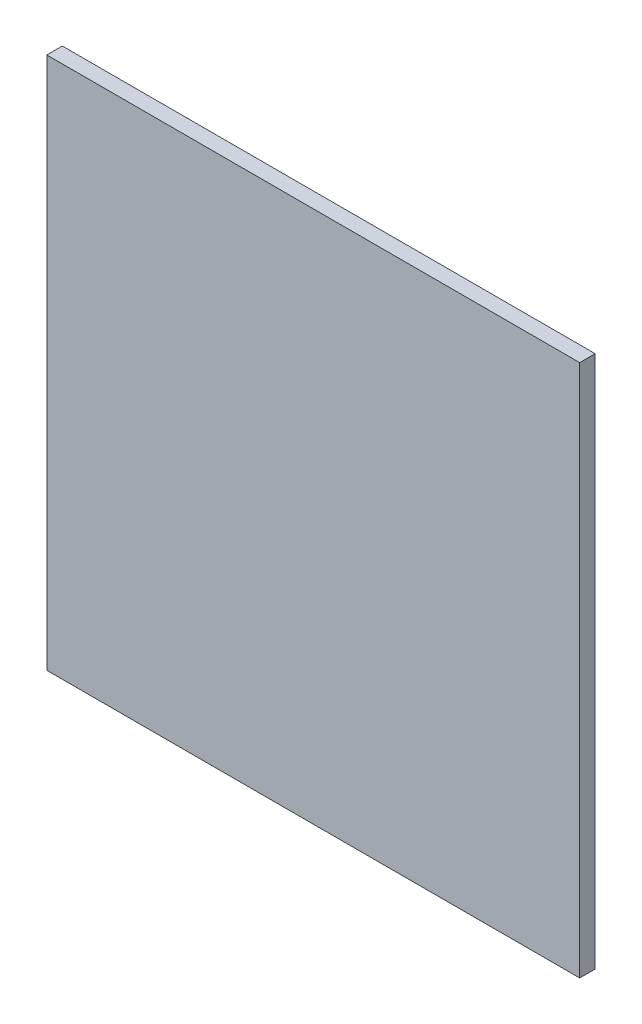
ISO-10303-21;
HEADER;
FILE_DESCRIPTION(('STEP AP214'),'2;1');
FILE_NAME('part.step','',(''),(''),'','','');
FILE_SCHEMA(('AUTOMOTIVE_DESIGN { 1 0 10303 214 1 1 1 1 }'));
ENDSEC;
DATA;
#1=APPLICATION_CONTEXT('core data for automotive mechanical design processes');
#2=APPLICATION_PROTOCOL_DEFINITION('international standard','automotive_design',2000,#1);
#3=PRODUCT_CONTEXT('',#1,'mechanical');
#4=PRODUCT('Part','Part','',(#3));
#5=PRODUCT_RELATED_PRODUCT_CATEGORY('part','',(#4));
#6=PRODUCT_DEFINITION_FORMATION('','',#4);
#7=PRODUCT_DEFINITION_CONTEXT('part definition',#1,'design');
#8=PRODUCT_DEFINITION('design','',#6,#7);
#9=PRODUCT_DEFINITION_SHAPE('','',#8);
#10=(LENGTH_UNIT() NAMED_UNIT(*) SI_UNIT(.MILLI.,.METRE.));
#11=(NAMED_UNIT(*) PLANE_ANGLE_UNIT() SI_UNIT($,.RADIAN.));
#12=(NAMED_UNIT(*) SI_UNIT($,.STERADIAN.) SOLID_ANGLE_UNIT());
#13=UNCERTAINTY_MEASURE_WITH_UNIT(LENGTH_MEASURE(1.E-05),#10,'distance_accuracy_value','');
#14=(GEOMETRIC_REPRESENTATION_CONTEXT(3) GLOBAL_UNCERTAINTY_ASSIGNED_CONTEXT((#13)) GLOBAL_UNIT_ASSIGNED_CONTEXT((#10,
#11,#12)) REPRESENTATION_CONTEXT('',''));
#15=CARTESIAN_POINT('',(0.,0.,0.));
#16=DIRECTION('',(0.,0.,1.));
#17=DIRECTION('',(1.,0.,0.));
#18=AXIS2_PLACEMENT_3D('',#15,#16,#17);
#19=CARTESIAN_POINT('',(-35.1974992724407,58.1059818265907,2.5));
#20=DIRECTION('',(1.,0.,0.));
#21=DIRECTION('',(0.,1.,0.));
#22=AXIS2_PLACEMENT_3D('',#19,#20,#21);
#23=PLANE('',#22);
#24=DIRECTION('',(0.,-1.,0.));
#25=VECTOR('',#24,1.);
#26=CARTESIAN_POINT('',(-35.1974992724407,58.1059818265907,0.));
#27=LINE('',#26,#25);
#28=CARTESIAN_POINT('',(-35.1974992724407,58.1059818265907,0.));
#29=VERTEX_POINT('',#28);
#30=CARTESIAN_POINT('',(-35.1974992724407,-27.8940181734093,0.));
#31=VERTEX_POINT('',#30);
#32=EDGE_CURVE('E95',#29,#31,#27,.T.);
#33=ORIENTED_EDGE('',*,*,#32,.T.);
#34=DIRECTION('',(0.,0.,-1.));
#35=VECTOR('',#34,1.);
#36=CARTESIAN_POINT('',(-35.1974992724407,-27.8940181734093,2.5));
#37=LINE('',#36,#35);
#38=CARTESIAN_POINT('',(-35.1974992724407,-27.8940181734093,2.5));
#39=VERTEX_POINT('',#38);
#40=EDGE_CURVE('E11',#39,#31,#37,.T.);
#41=ORIENTED_EDGE('',*,*,#40,.F.);
#42=DIRECTION('',(0.,-1.,0.));
#43=VECTOR('',#42,1.);
#44=CARTESIAN_POINT('',(-35.1974992724407,58.1059818265907,2.5));
#45=LINE('',#44,#43);
#46=CARTESIAN_POINT('',(-35.1974992724407,58.1059818265907,2.5));
#47=VERTEX_POINT('',#46);
#48=EDGE_CURVE('E83',#47,#39,#45,.T.);
#49=ORIENTED_EDGE('',*,*,#48,.F.);
#50=DIRECTION('',(0.,0.,-1.));
#51=VECTOR('',#50,1.);
#52=CARTESIAN_POINT('',(-35.1974992724407,58.1059818265907,2.5));
#53=LINE('',#52,#51);
#54=EDGE_CURVE('E91',#47,#29,#53,.T.);
#55=ORIENTED_EDGE('',*,*,#54,.T.);
#56=EDGE_LOOP('',(#33,#41,#49,#55));
#57=FACE_BOUND('',#56,.T.);
#58=ADVANCED_FACE('F32',(#57),#23,.F.);
#59=CARTESIAN_POINT('',(-35.1974992724407,-27.8940181734093,2.5));
#60=DIRECTION('',(0.,1.,0.));
#61=DIRECTION('',(0.,0.,1.));
#62=AXIS2_PLACEMENT_3D('',#59,#60,#61);
#63=PLANE('',#62);
#64=DIRECTION('',(1.,0.,0.));
#65=VECTOR('',#64,1.);
#66=CARTESIAN_POINT('',(-35.1974992724407,-27.8940181734093,0.));
#67=LINE('',#66,#65);
#68=CARTESIAN_POINT('',(50.8025007275593,-27.8940181734093,0.));
#69=VERTEX_POINT('',#68);
#70=EDGE_CURVE('E87',#31,#69,#67,.T.);
#71=ORIENTED_EDGE('',*,*,#70,.T.);
#72=DIRECTION('',(0.,0.,-1.));
#73=VECTOR('',#72,1.);
#74=CARTESIAN_POINT('',(50.8025007275593,-27.8940181734093,2.5));
#75=LINE('',#74,#73);
#76=CARTESIAN_POINT('',(50.8025007275593,-27.8940181734093,2.5));
#77=VERTEX_POINT('',#76);
#78=EDGE_CURVE('E40',#77,#69,#75,.T.);
#79=ORIENTED_EDGE('',*,*,#78,.F.);
#80=DIRECTION('',(1.,0.,0.));
#81=VECTOR('',#80,1.);
#82=CARTESIAN_POINT('',(-35.1974992724407,-27.8940181734093,2.5));
#83=LINE('',#82,#81);
#84=EDGE_CURVE('E78',#39,#77,#83,.T.);
#85=ORIENTED_EDGE('',*,*,#84,.F.);
#86=ORIENTED_EDGE('',*,*,#40,.T.);
#87=EDGE_LOOP('',(#71,#79,#85,#86));
#88=FACE_BOUND('',#87,.T.);
#89=ADVANCED_FACE('F86',(#88),#63,.F.);
#90=CARTESIAN_POINT('',(50.8025007275593,58.1059818265907,2.5));
#91=DIRECTION('',(-1.,0.,0.));
#92=DIRECTION('',(0.,-1.,0.));
#93=AXIS2_PLACEMENT_3D('',#90,#91,#92);
#94=PLANE('',#93);
#95=DIRECTION('',(0.,1.,0.));
#96=VECTOR('',#95,1.);
#97=CARTESIAN_POINT('',(50.8025007275593,58.1059818265907,0.));
#98=LINE('',#97,#96);
#99=CARTESIAN_POINT('',(50.8025007275593,58.1059818265907,0.));
#100=VERTEX_POINT('',#99);
#101=EDGE_CURVE('E65',#69,#100,#98,.T.);
#102=ORIENTED_EDGE('',*,*,#101,.T.);
#103=DIRECTION('',(0.,0.,-1.));
#104=VECTOR('',#103,1.);
#105=CARTESIAN_POINT('',(50.8025007275593,58.1059818265907,2.5));
#106=LINE('',#105,#104);
#107=CARTESIAN_POINT('',(50.8025007275593,58.1059818265907,2.5));
#108=VERTEX_POINT('',#107);
#109=EDGE_CURVE('E88',#108,#100,#106,.T.);
#110=ORIENTED_EDGE('',*,*,#109,.F.);
#111=DIRECTION('',(0.,1.,0.));
#112=VECTOR('',#111,1.);
#113=CARTESIAN_POINT('',(50.8025007275593,58.1059818265907,2.5));
#114=LINE('',#113,#112);
#115=EDGE_CURVE('E81',#77,#108,#114,.T.);
#116=ORIENTED_EDGE('',*,*,#115,.F.);
#117=ORIENTED_EDGE('',*,*,#78,.T.);
#118=EDGE_LOOP('',(#102,#110,#116,#117));
#119=FACE_BOUND('',#118,.T.);
#120=ADVANCED_FACE('F89',(#119),#94,.F.);
#121=CARTESIAN_POINT('',(-35.1974992724407,58.1059818265907,2.5));
#122=DIRECTION('',(0.,-1.,0.));
#123=DIRECTION('',(0.,0.,-1.));
#124=AXIS2_PLACEMENT_3D('',#121,#122,#123);
#125=PLANE('',#124);
#126=DIRECTION('',(-1.,0.,0.));
#127=VECTOR('',#126,1.);
#128=CARTESIAN_POINT('',(-35.1974992724407,58.1059818265907,0.));
#129=LINE('',#128,#127);
#130=EDGE_CURVE('E71',#100,#29,#129,.T.);
#131=ORIENTED_EDGE('',*,*,#130,.T.);
#132=ORIENTED_EDGE('',*,*,#54,.F.);
#133=DIRECTION('',(-1.,0.,0.));
#134=VECTOR('',#133,1.);
#135=CARTESIAN_POINT('',(-35.1974992724407,58.1059818265907,2.5));
#136=LINE('',#135,#134);
#137=EDGE_CURVE('E48',#108,#47,#136,.T.);
#138=ORIENTED_EDGE('',*,*,#137,.F.);
#139=ORIENTED_EDGE('',*,*,#109,.T.);
#140=EDGE_LOOP('',(#131,#132,#138,#139));
#141=FACE_BOUND('',#140,.T.);
#142=ADVANCED_FACE('F102',(#141),#125,.F.);
#143=CARTESIAN_POINT('',(0.,0.,2.5));
#144=DIRECTION('',(0.,0.,1.));
#145=DIRECTION('',(1.,0.,0.));
#146=AXIS2_PLACEMENT_3D('',#143,#144,#145);
#147=PLANE('',#146);
#148=ORIENTED_EDGE('',*,*,#48,.T.);
#149=ORIENTED_EDGE('',*,*,#84,.T.);
#150=ORIENTED_EDGE('',*,*,#115,.T.);
#151=ORIENTED_EDGE('',*,*,#137,.T.);
#152=EDGE_LOOP('',(#148,#149,#150,#151));
#153=FACE_BOUND('',#152,.T.);
#154=ADVANCED_FACE('F79',(#153),#147,.T.);
#155=CARTESIAN_POINT('',(0.,0.,0.));
#156=DIRECTION('',(0.,0.,1.));
#157=DIRECTION('',(1.,0.,0.));
#158=AXIS2_PLACEMENT_3D('',#155,#156,#157);
#159=PLANE('',#158);
#160=ORIENTED_EDGE('',*,*,#32,.F.);
#161=ORIENTED_EDGE('',*,*,#130,.F.);
#162=ORIENTED_EDGE('',*,*,#101,.F.);
#163=ORIENTED_EDGE('',*,*,#70,.F.);
#164=EDGE_LOOP('',(#160,#161,#162,#163));
#165=FACE_BOUND('',#164,.T.);
#166=ADVANCED_FACE('F105',(#165),#159,.F.);
#167=CLOSED_SHELL('',(#58,#89,#120,#142,#154,#166));
#168=MANIFOLD_SOLID_BREP('B2',#167);
#169=ADVANCED_BREP_SHAPE_REPRESENTATION('',(#18,#168),#14);
#170=SHAPE_DEFINITION_REPRESENTATION(#9,#169);
ENDSEC;
END-ISO-10303-21;
